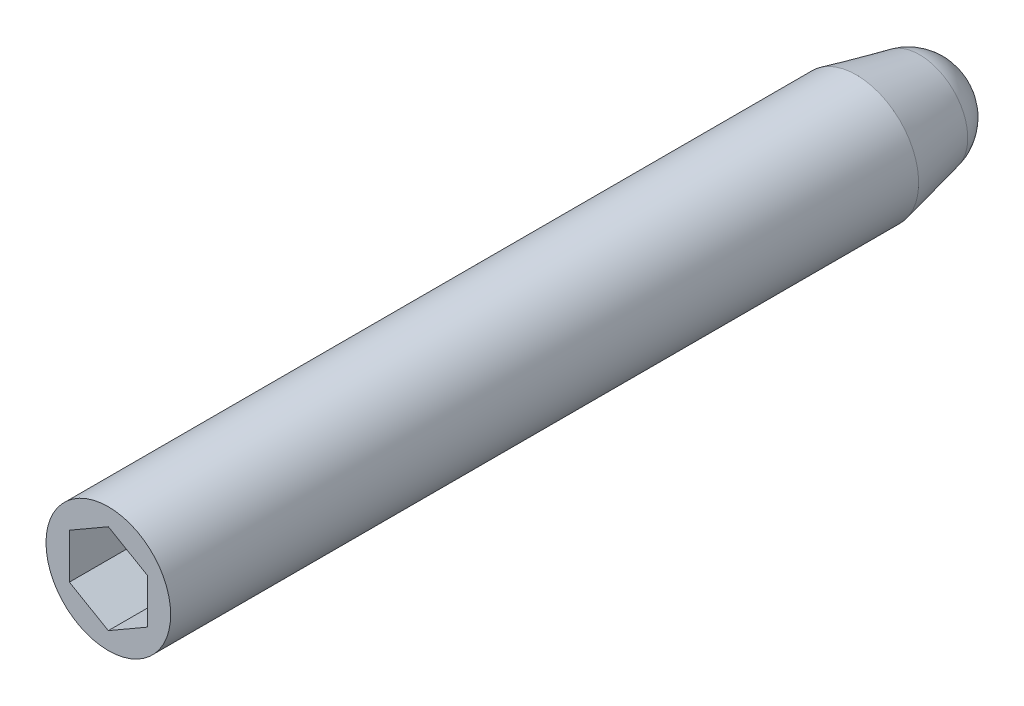
ISO-10303-21;
HEADER;
FILE_DESCRIPTION(('STEP AP214'),'2;1');
FILE_NAME('part.step','',(''),(''),'','','');
FILE_SCHEMA(('AUTOMOTIVE_DESIGN { 1 0 10303 214 1 1 1 1 }'));
ENDSEC;
DATA;
#1=APPLICATION_CONTEXT('core data for automotive mechanical design processes');
#2=APPLICATION_PROTOCOL_DEFINITION('international standard','automotive_design',2000,#1);
#3=PRODUCT_CONTEXT('',#1,'mechanical');
#4=PRODUCT('Part','Part','',(#3));
#5=PRODUCT_RELATED_PRODUCT_CATEGORY('part','',(#4));
#6=PRODUCT_DEFINITION_FORMATION('','',#4);
#7=PRODUCT_DEFINITION_CONTEXT('part definition',#1,'design');
#8=PRODUCT_DEFINITION('design','',#6,#7);
#9=PRODUCT_DEFINITION_SHAPE('','',#8);
#10=(LENGTH_UNIT() NAMED_UNIT(*) SI_UNIT(.MILLI.,.METRE.));
#11=(NAMED_UNIT(*) PLANE_ANGLE_UNIT() SI_UNIT($,.RADIAN.));
#12=(NAMED_UNIT(*) SI_UNIT($,.STERADIAN.) SOLID_ANGLE_UNIT());
#13=UNCERTAINTY_MEASURE_WITH_UNIT(LENGTH_MEASURE(1.E-05),#10,'distance_accuracy_value','');
#14=(GEOMETRIC_REPRESENTATION_CONTEXT(3) GLOBAL_UNCERTAINTY_ASSIGNED_CONTEXT((#13)) GLOBAL_UNIT_ASSIGNED_CONTEXT((#10,
#11,#12)) REPRESENTATION_CONTEXT('',''));
#15=CARTESIAN_POINT('',(0.,0.,0.));
#16=DIRECTION('',(0.,0.,1.));
#17=DIRECTION('',(1.,0.,0.));
#18=AXIS2_PLACEMENT_3D('',#15,#16,#17);
#19=CARTESIAN_POINT('',(0.,0.,38.1));
#20=DIRECTION('',(0.,0.,-1.));
#21=DIRECTION('',(-1.,0.,0.));
#22=AXIS2_PLACEMENT_3D('',#19,#20,#21);
#23=CYLINDRICAL_SURFACE('',#22,3.175);
#24=CARTESIAN_POINT('',(0.,0.,38.1));
#25=DIRECTION('',(0.,0.,1.));
#26=DIRECTION('',(1.,0.,0.));
#27=AXIS2_PLACEMENT_3D('',#24,#25,#26);
#28=CIRCLE('',#27,3.175);
#29=CARTESIAN_POINT('',(3.175,0.,38.1));
#30=VERTEX_POINT('',#29);
#31=EDGE_CURVE('E11',#30,#30,#28,.T.);
#32=ORIENTED_EDGE('',*,*,#31,.F.);
#33=EDGE_LOOP('',(#32));
#34=FACE_BOUND('',#33,.T.);
#35=CARTESIAN_POINT('',(0.,0.,0.));
#36=DIRECTION('',(0.,0.,-1.));
#37=DIRECTION('',(-1.,0.,0.));
#38=AXIS2_PLACEMENT_3D('',#35,#36,#37);
#39=CIRCLE('',#38,3.175);
#40=CARTESIAN_POINT('',(-3.175,0.,0.));
#41=VERTEX_POINT('',#40);
#42=EDGE_CURVE('E122',#41,#41,#39,.T.);
#43=ORIENTED_EDGE('',*,*,#42,.F.);
#44=EDGE_LOOP('',(#43));
#45=FACE_BOUND('',#44,.T.);
#46=ADVANCED_FACE('F32',(#34,#45),#23,.T.);
#47=CARTESIAN_POINT('',(0.,0.,38.1));
#48=DIRECTION('',(0.,0.,1.));
#49=DIRECTION('',(1.,0.,0.));
#50=AXIS2_PLACEMENT_3D('',#47,#48,#49);
#51=PLANE('',#50);
#52=DIRECTION('',(-0.866025403784438,0.5,0.));
#53=VECTOR('',#52,1.);
#54=CARTESIAN_POINT('',(1.984375,1.14567944042316,38.1));
#55=LINE('',#54,#53);
#56=CARTESIAN_POINT('',(1.984375,1.14567944042316,38.1));
#57=VERTEX_POINT('',#56);
#58=CARTESIAN_POINT('',(0.,2.29135888084633,38.1));
#59=VERTEX_POINT('',#58);
#60=EDGE_CURVE('E46',#57,#59,#55,.T.);
#61=ORIENTED_EDGE('',*,*,#60,.F.);
#62=DIRECTION('',(0.,1.,0.));
#63=VECTOR('',#62,1.);
#64=CARTESIAN_POINT('',(1.984375,-1.14567944042316,38.1));
#65=LINE('',#64,#63);
#66=CARTESIAN_POINT('',(1.984375,-1.14567944042316,38.1));
#67=VERTEX_POINT('',#66);
#68=EDGE_CURVE('E131',#67,#57,#65,.T.);
#69=ORIENTED_EDGE('',*,*,#68,.F.);
#70=DIRECTION('',(0.866025403784439,0.5,0.));
#71=VECTOR('',#70,1.);
#72=CARTESIAN_POINT('',(0.,-2.29135888084633,38.1));
#73=LINE('',#72,#71);
#74=CARTESIAN_POINT('',(0.,-2.29135888084633,38.1));
#75=VERTEX_POINT('',#74);
#76=EDGE_CURVE('E129',#75,#67,#73,.T.);
#77=ORIENTED_EDGE('',*,*,#76,.F.);
#78=DIRECTION('',(0.866025403784439,-0.5,0.));
#79=VECTOR('',#78,1.);
#80=CARTESIAN_POINT('',(-1.984375,-1.14567944042316,38.1));
#81=LINE('',#80,#79);
#82=CARTESIAN_POINT('',(-1.984375,-1.14567944042316,38.1));
#83=VERTEX_POINT('',#82);
#84=EDGE_CURVE('E95',#83,#75,#81,.T.);
#85=ORIENTED_EDGE('',*,*,#84,.F.);
#86=DIRECTION('',(0.,-1.,0.));
#87=VECTOR('',#86,1.);
#88=CARTESIAN_POINT('',(-1.984375,1.14567944042316,38.1));
#89=LINE('',#88,#87);
#90=CARTESIAN_POINT('',(-1.984375,1.14567944042316,38.1));
#91=VERTEX_POINT('',#90);
#92=EDGE_CURVE('E125',#91,#83,#89,.T.);
#93=ORIENTED_EDGE('',*,*,#92,.F.);
#94=DIRECTION('',(-0.866025403784438,-0.5,0.));
#95=VECTOR('',#94,1.);
#96=CARTESIAN_POINT('',(0.,2.29135888084633,38.1));
#97=LINE('',#96,#95);
#98=EDGE_CURVE('E121',#59,#91,#97,.T.);
#99=ORIENTED_EDGE('',*,*,#98,.F.);
#100=EDGE_LOOP('',(#61,#69,#77,#85,#93,#99));
#101=FACE_BOUND('',#100,.T.);
#102=ORIENTED_EDGE('',*,*,#31,.T.);
#103=EDGE_LOOP('',(#102));
#104=FACE_BOUND('',#103,.T.);
#105=ADVANCED_FACE('F143',(#101,#104),#51,.T.);
#106=CARTESIAN_POINT('',(1.984375,1.14567944042316,34.925));
#107=DIRECTION('',(0.5,0.866025403784438,0.));
#108=DIRECTION('',(-0.866025403784439,0.5,0.));
#109=AXIS2_PLACEMENT_3D('',#106,#107,#108);
#110=PLANE('',#109);
#111=ORIENTED_EDGE('',*,*,#60,.T.);
#112=DIRECTION('',(0.,0.,1.));
#113=VECTOR('',#112,1.);
#114=CARTESIAN_POINT('',(0.,2.29135888084633,34.925));
#115=LINE('',#114,#113);
#116=CARTESIAN_POINT('',(0.,2.29135888084633,34.925));
#117=VERTEX_POINT('',#116);
#118=EDGE_CURVE('E76',#117,#59,#115,.T.);
#119=ORIENTED_EDGE('',*,*,#118,.F.);
#120=DIRECTION('',(-0.866025403784438,0.5,0.));
#121=VECTOR('',#120,1.);
#122=CARTESIAN_POINT('',(1.984375,1.14567944042316,34.925));
#123=LINE('',#122,#121);
#124=CARTESIAN_POINT('',(1.984375,1.14567944042316,34.925));
#125=VERTEX_POINT('',#124);
#126=EDGE_CURVE('E133',#125,#117,#123,.T.);
#127=ORIENTED_EDGE('',*,*,#126,.F.);
#128=DIRECTION('',(0.,0.,1.));
#129=VECTOR('',#128,1.);
#130=CARTESIAN_POINT('',(1.984375,1.14567944042316,34.925));
#131=LINE('',#130,#129);
#132=EDGE_CURVE('E39',#125,#57,#131,.T.);
#133=ORIENTED_EDGE('',*,*,#132,.T.);
#134=EDGE_LOOP('',(#111,#119,#127,#133));
#135=FACE_BOUND('',#134,.T.);
#136=ADVANCED_FACE('F174',(#135),#110,.F.);
#137=CARTESIAN_POINT('',(1.984375,-1.14567944042316,34.925));
#138=DIRECTION('',(1.,0.,0.));
#139=DIRECTION('',(0.,0.,-1.));
#140=AXIS2_PLACEMENT_3D('',#137,#138,#139);
#141=PLANE('',#140);
#142=ORIENTED_EDGE('',*,*,#68,.T.);
#143=ORIENTED_EDGE('',*,*,#132,.F.);
#144=DIRECTION('',(0.,1.,0.));
#145=VECTOR('',#144,1.);
#146=CARTESIAN_POINT('',(1.984375,-1.14567944042316,34.925));
#147=LINE('',#146,#145);
#148=CARTESIAN_POINT('',(1.984375,-1.14567944042316,34.925));
#149=VERTEX_POINT('',#148);
#150=EDGE_CURVE('E107',#149,#125,#147,.T.);
#151=ORIENTED_EDGE('',*,*,#150,.F.);
#152=DIRECTION('',(0.,0.,1.));
#153=VECTOR('',#152,1.);
#154=CARTESIAN_POINT('',(1.984375,-1.14567944042316,34.925));
#155=LINE('',#154,#153);
#156=EDGE_CURVE('E99',#149,#67,#155,.T.);
#157=ORIENTED_EDGE('',*,*,#156,.T.);
#158=EDGE_LOOP('',(#142,#143,#151,#157));
#159=FACE_BOUND('',#158,.T.);
#160=ADVANCED_FACE('F181',(#159),#141,.F.);
#161=CARTESIAN_POINT('',(0.,-2.29135888084633,34.925));
#162=DIRECTION('',(0.5,-0.866025403784439,0.));
#163=DIRECTION('',(0.866025403784439,0.5,0.));
#164=AXIS2_PLACEMENT_3D('',#161,#162,#163);
#165=PLANE('',#164);
#166=ORIENTED_EDGE('',*,*,#76,.T.);
#167=ORIENTED_EDGE('',*,*,#156,.F.);
#168=DIRECTION('',(0.866025403784439,0.5,0.));
#169=VECTOR('',#168,1.);
#170=CARTESIAN_POINT('',(0.,-2.29135888084633,34.925));
#171=LINE('',#170,#169);
#172=CARTESIAN_POINT('',(0.,-2.29135888084633,34.925));
#173=VERTEX_POINT('',#172);
#174=EDGE_CURVE('E103',#173,#149,#171,.T.);
#175=ORIENTED_EDGE('',*,*,#174,.F.);
#176=DIRECTION('',(0.,0.,1.));
#177=VECTOR('',#176,1.);
#178=CARTESIAN_POINT('',(0.,-2.29135888084633,34.925));
#179=LINE('',#178,#177);
#180=EDGE_CURVE('E88',#173,#75,#179,.T.);
#181=ORIENTED_EDGE('',*,*,#180,.T.);
#182=EDGE_LOOP('',(#166,#167,#175,#181));
#183=FACE_BOUND('',#182,.T.);
#184=ADVANCED_FACE('F104',(#183),#165,.F.);
#185=CARTESIAN_POINT('',(-1.984375,-1.14567944042316,34.925));
#186=DIRECTION('',(-0.5,-0.866025403784439,0.));
#187=DIRECTION('',(0.866025403784439,-0.5,0.));
#188=AXIS2_PLACEMENT_3D('',#185,#186,#187);
#189=PLANE('',#188);
#190=ORIENTED_EDGE('',*,*,#84,.T.);
#191=ORIENTED_EDGE('',*,*,#180,.F.);
#192=DIRECTION('',(0.866025403784439,-0.5,0.));
#193=VECTOR('',#192,1.);
#194=CARTESIAN_POINT('',(-1.984375,-1.14567944042316,34.925));
#195=LINE('',#194,#193);
#196=CARTESIAN_POINT('',(-1.984375,-1.14567944042316,34.925));
#197=VERTEX_POINT('',#196);
#198=EDGE_CURVE('E92',#197,#173,#195,.T.);
#199=ORIENTED_EDGE('',*,*,#198,.F.);
#200=DIRECTION('',(0.,0.,1.));
#201=VECTOR('',#200,1.);
#202=CARTESIAN_POINT('',(-1.984375,-1.14567944042316,34.925));
#203=LINE('',#202,#201);
#204=EDGE_CURVE('E100',#197,#83,#203,.T.);
#205=ORIENTED_EDGE('',*,*,#204,.T.);
#206=EDGE_LOOP('',(#190,#191,#199,#205));
#207=FACE_BOUND('',#206,.T.);
#208=ADVANCED_FACE('F90',(#207),#189,.F.);
#209=CARTESIAN_POINT('',(-1.984375,1.14567944042316,34.925));
#210=DIRECTION('',(-1.,0.,0.));
#211=DIRECTION('',(0.,0.,1.));
#212=AXIS2_PLACEMENT_3D('',#209,#210,#211);
#213=PLANE('',#212);
#214=ORIENTED_EDGE('',*,*,#92,.T.);
#215=ORIENTED_EDGE('',*,*,#204,.F.);
#216=DIRECTION('',(0.,-1.,0.));
#217=VECTOR('',#216,1.);
#218=CARTESIAN_POINT('',(-1.984375,1.14567944042316,34.925));
#219=LINE('',#218,#217);
#220=CARTESIAN_POINT('',(-1.984375,1.14567944042316,34.925));
#221=VERTEX_POINT('',#220);
#222=EDGE_CURVE('E113',#221,#197,#219,.T.);
#223=ORIENTED_EDGE('',*,*,#222,.F.);
#224=DIRECTION('',(0.,0.,1.));
#225=VECTOR('',#224,1.);
#226=CARTESIAN_POINT('',(-1.984375,1.14567944042316,34.925));
#227=LINE('',#226,#225);
#228=EDGE_CURVE('E137',#221,#91,#227,.T.);
#229=ORIENTED_EDGE('',*,*,#228,.T.);
#230=EDGE_LOOP('',(#214,#215,#223,#229));
#231=FACE_BOUND('',#230,.T.);
#232=ADVANCED_FACE('F147',(#231),#213,.F.);
#233=CARTESIAN_POINT('',(0.,2.29135888084633,34.925));
#234=DIRECTION('',(-0.5,0.866025403784438,0.));
#235=DIRECTION('',(-0.866025403784439,-0.5,0.));
#236=AXIS2_PLACEMENT_3D('',#233,#234,#235);
#237=PLANE('',#236);
#238=ORIENTED_EDGE('',*,*,#98,.T.);
#239=ORIENTED_EDGE('',*,*,#228,.F.);
#240=DIRECTION('',(-0.866025403784438,-0.5,0.));
#241=VECTOR('',#240,1.);
#242=CARTESIAN_POINT('',(0.,2.29135888084633,34.925));
#243=LINE('',#242,#241);
#244=EDGE_CURVE('E115',#117,#221,#243,.T.);
#245=ORIENTED_EDGE('',*,*,#244,.F.);
#246=ORIENTED_EDGE('',*,*,#118,.T.);
#247=EDGE_LOOP('',(#238,#239,#245,#246));
#248=FACE_BOUND('',#247,.T.);
#249=ADVANCED_FACE('F140',(#248),#237,.F.);
#250=CARTESIAN_POINT('',(0.,0.,34.925));
#251=DIRECTION('',(0.,0.,1.));
#252=DIRECTION('',(1.,0.,0.));
#253=AXIS2_PLACEMENT_3D('',#250,#251,#252);
#254=PLANE('',#253);
#255=ORIENTED_EDGE('',*,*,#126,.T.);
#256=ORIENTED_EDGE('',*,*,#244,.T.);
#257=ORIENTED_EDGE('',*,*,#222,.T.);
#258=ORIENTED_EDGE('',*,*,#198,.T.);
#259=ORIENTED_EDGE('',*,*,#174,.T.);
#260=ORIENTED_EDGE('',*,*,#150,.T.);
#261=EDGE_LOOP('',(#255,#256,#257,#258,#259,#260));
#262=FACE_BOUND('',#261,.T.);
#263=ADVANCED_FACE('F110',(#262),#254,.T.);
#264=CARTESIAN_POINT('',(0.,0.,-3.22242981925541));
#265=DIRECTION('',(0.,0.,1.));
#266=DIRECTION('',(1.,0.,0.));
#267=AXIS2_PLACEMENT_3D('',#264,#265,#266);
#268=CONICAL_SURFACE('',#267,2.45371597882988,0.22020277342663);
#269=ORIENTED_EDGE('',*,*,#42,.T.);
#270=EDGE_LOOP('',(#269));
#271=FACE_BOUND('',#270,.T.);
#272=CARTESIAN_POINT('',(0.,0.,-3.22242981925541));
#273=DIRECTION('',(0.,0.,-1.));
#274=DIRECTION('',(-1.,0.,0.));
#275=AXIS2_PLACEMENT_3D('',#272,#273,#274);
#276=CIRCLE('',#275,2.45371597882988);
#277=CARTESIAN_POINT('',(-2.45371597882988,0.,-3.22242981925541));
#278=VERTEX_POINT('',#277);
#279=EDGE_CURVE('E152',#278,#278,#276,.T.);
#280=ORIENTED_EDGE('',*,*,#279,.F.);
#281=EDGE_LOOP('',(#280));
#282=FACE_BOUND('',#281,.T.);
#283=ADVANCED_FACE('F159',(#271,#282),#268,.T.);
#284=CARTESIAN_POINT('',(-0.12996559848062,0.,-2.70229932377695));
#285=DIRECTION('',(0.,-1.,0.));
#286=DIRECTION('',(-1.,0.,0.));
#287=AXIS2_PLACEMENT_3D('',#284,#285,#286);
#288=CIRCLE('',#287,2.38125);
#289=TRIMMED_CURVE('',#288,(PARAMETER_VALUE(-1.62540218906514)),
(PARAMETER_VALUE(1.62540218906514)),.T.,.PARAMETER.);
#290=CARTESIAN_POINT('',(0.,0.,-2.70229932377695));
#291=DIRECTION('',(0.,0.,-1.));
#292=AXIS1_PLACEMENT('',#290,#291);
#293=SURFACE_OF_REVOLUTION('',#289,#292);
#294=ORIENTED_EDGE('',*,*,#279,.T.);
#295=EDGE_LOOP('',(#294));
#296=FACE_BOUND('',#295,.T.);
#297=CARTESIAN_POINT('',(0.,0.,-5.08));
#298=VERTEX_POINT('',#297);
#299=VERTEX_LOOP('',#298);
#300=FACE_BOUND('',#299,.T.);
#301=ADVANCED_FACE('F156',(#296,#300),#293,.T.);
#302=CLOSED_SHELL('',(#46,#105,#136,#160,#184,#208,#232,#249,#263,#283,#301));
#303=MANIFOLD_SOLID_BREP('B2',#302);
#304=ADVANCED_BREP_SHAPE_REPRESENTATION('',(#18,#303),#14);
#305=SHAPE_DEFINITION_REPRESENTATION(#9,#304);
ENDSEC;
END-ISO-10303-21;
